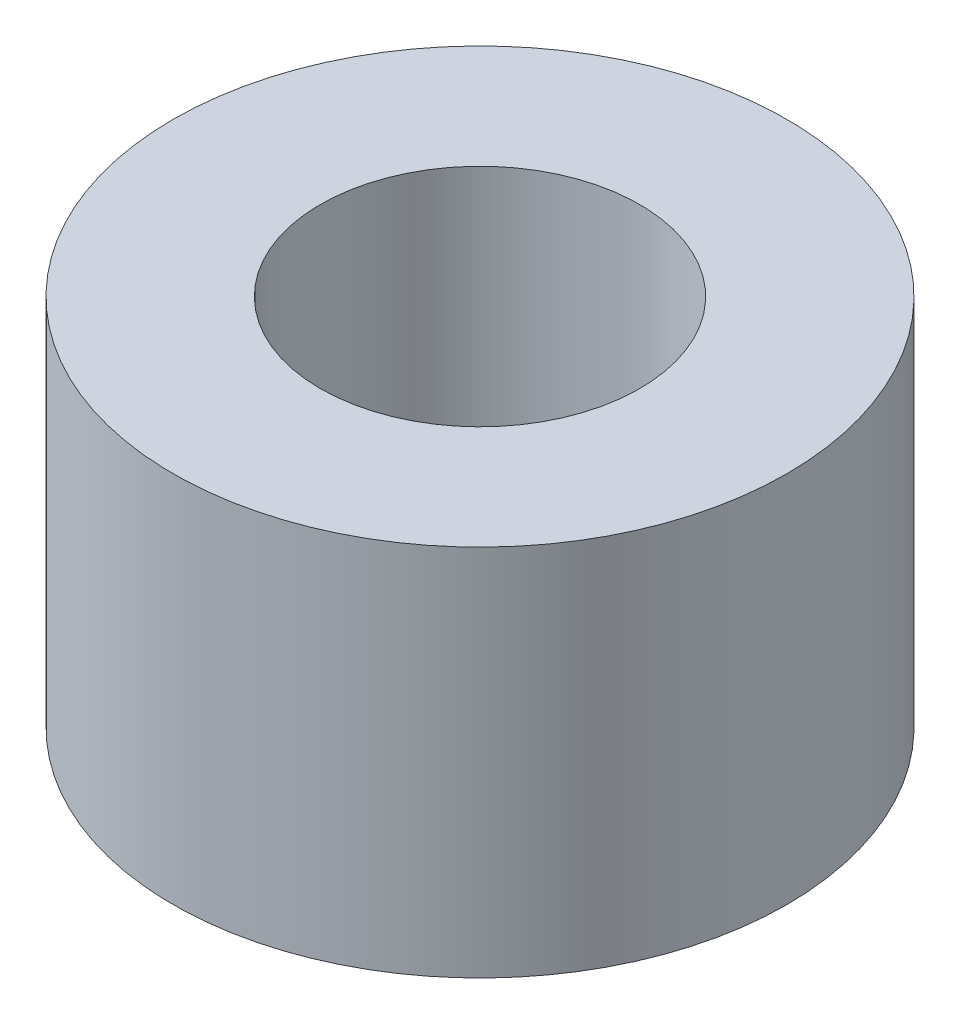
ISO-10303-21;
HEADER;
FILE_DESCRIPTION(('STEP AP214'),'2;1');
FILE_NAME('part.step','',(''),(''),'','','');
FILE_SCHEMA(('AUTOMOTIVE_DESIGN { 1 0 10303 214 1 1 1 1 }'));
ENDSEC;
DATA;
#1=APPLICATION_CONTEXT('core data for automotive mechanical design processes');
#2=APPLICATION_PROTOCOL_DEFINITION('international standard','automotive_design',2000,#1);
#3=PRODUCT_CONTEXT('',#1,'mechanical');
#4=PRODUCT('Part','Part','',(#3));
#5=PRODUCT_RELATED_PRODUCT_CATEGORY('part','',(#4));
#6=PRODUCT_DEFINITION_FORMATION('','',#4);
#7=PRODUCT_DEFINITION_CONTEXT('part definition',#1,'design');
#8=PRODUCT_DEFINITION('design','',#6,#7);
#9=PRODUCT_DEFINITION_SHAPE('','',#8);
#10=(LENGTH_UNIT() NAMED_UNIT(*) SI_UNIT(.MILLI.,.METRE.));
#11=(NAMED_UNIT(*) PLANE_ANGLE_UNIT() SI_UNIT($,.RADIAN.));
#12=(NAMED_UNIT(*) SI_UNIT($,.STERADIAN.) SOLID_ANGLE_UNIT());
#13=UNCERTAINTY_MEASURE_WITH_UNIT(LENGTH_MEASURE(1.E-05),#10,'distance_accuracy_value','');
#14=(GEOMETRIC_REPRESENTATION_CONTEXT(3) GLOBAL_UNCERTAINTY_ASSIGNED_CONTEXT((#13)) GLOBAL_UNIT_ASSIGNED_CONTEXT((#10,
#11,#12)) REPRESENTATION_CONTEXT('',''));
#15=CARTESIAN_POINT('',(0.,0.,0.));
#16=DIRECTION('',(0.,0.,1.));
#17=DIRECTION('',(1.,0.,0.));
#18=AXIS2_PLACEMENT_3D('',#15,#16,#17);
#19=CARTESIAN_POINT('',(0.,7.6,0.));
#20=DIRECTION('',(0.,1.,0.));
#21=DIRECTION('',(0.,0.,1.));
#22=AXIS2_PLACEMENT_3D('',#19,#20,#21);
#23=PLANE('',#22);
#24=CARTESIAN_POINT('',(0.,7.6,0.));
#25=DIRECTION('',(0.,1.,0.));
#26=DIRECTION('',(1.,0.,0.));
#27=AXIS2_PLACEMENT_3D('',#24,#25,#26);
#28=CIRCLE('',#27,6.25);
#29=CARTESIAN_POINT('',(6.25,7.6,0.));
#30=VERTEX_POINT('',#29);
#31=EDGE_CURVE('E11',#30,#30,#28,.T.);
#32=ORIENTED_EDGE('',*,*,#31,.T.);
#33=EDGE_LOOP('',(#32));
#34=FACE_BOUND('',#33,.T.);
#35=CARTESIAN_POINT('',(0.,7.6,0.));
#36=DIRECTION('',(0.,1.,0.));
#37=DIRECTION('',(0.,0.,1.));
#38=AXIS2_PLACEMENT_3D('',#35,#36,#37);
#39=CIRCLE('',#38,3.25);
#40=CARTESIAN_POINT('',(0.,7.6,3.25));
#41=VERTEX_POINT('',#40);
#42=EDGE_CURVE('E47',#41,#41,#39,.T.);
#43=ORIENTED_EDGE('',*,*,#42,.F.);
#44=EDGE_LOOP('',(#43));
#45=FACE_BOUND('',#44,.T.);
#46=ADVANCED_FACE('F36',(#34,#45),#23,.T.);
#47=CARTESIAN_POINT('',(0.,0.,0.));
#48=DIRECTION('',(0.,1.,0.));
#49=DIRECTION('',(0.,0.,1.));
#50=AXIS2_PLACEMENT_3D('',#47,#48,#49);
#51=PLANE('',#50);
#52=CARTESIAN_POINT('',(0.,0.,0.));
#53=DIRECTION('',(0.,1.,0.));
#54=DIRECTION('',(1.,0.,0.));
#55=AXIS2_PLACEMENT_3D('',#52,#53,#54);
#56=CIRCLE('',#55,6.25);
#57=CARTESIAN_POINT('',(6.25,0.,0.));
#58=VERTEX_POINT('',#57);
#59=EDGE_CURVE('E40',#58,#58,#56,.T.);
#60=ORIENTED_EDGE('',*,*,#59,.F.);
#61=EDGE_LOOP('',(#60));
#62=FACE_BOUND('',#61,.T.);
#63=CARTESIAN_POINT('',(0.,0.,0.));
#64=DIRECTION('',(0.,1.,0.));
#65=DIRECTION('',(0.,0.,1.));
#66=AXIS2_PLACEMENT_3D('',#63,#64,#65);
#67=CIRCLE('',#66,3.25);
#68=CARTESIAN_POINT('',(0.,0.,3.25));
#69=VERTEX_POINT('',#68);
#70=EDGE_CURVE('E49',#69,#69,#67,.T.);
#71=ORIENTED_EDGE('',*,*,#70,.T.);
#72=EDGE_LOOP('',(#71));
#73=FACE_BOUND('',#72,.T.);
#74=ADVANCED_FACE('F59',(#62,#73),#51,.F.);
#75=CARTESIAN_POINT('',(0.,7.6,0.));
#76=DIRECTION('',(0.,-1.,0.));
#77=DIRECTION('',(0.,0.,-1.));
#78=AXIS2_PLACEMENT_3D('',#75,#76,#77);
#79=CYLINDRICAL_SURFACE('',#78,6.25);
#80=ORIENTED_EDGE('',*,*,#31,.F.);
#81=EDGE_LOOP('',(#80));
#82=FACE_BOUND('',#81,.T.);
#83=ORIENTED_EDGE('',*,*,#59,.T.);
#84=EDGE_LOOP('',(#83));
#85=FACE_BOUND('',#84,.T.);
#86=ADVANCED_FACE('F38',(#82,#85),#79,.T.);
#87=CARTESIAN_POINT('',(0.,7.6,0.));
#88=DIRECTION('',(0.,-1.,0.));
#89=DIRECTION('',(0.,0.,-1.));
#90=AXIS2_PLACEMENT_3D('',#87,#88,#89);
#91=CYLINDRICAL_SURFACE('',#90,3.25);
#92=ORIENTED_EDGE('',*,*,#42,.T.);
#93=EDGE_LOOP('',(#92));
#94=FACE_BOUND('',#93,.T.);
#95=ORIENTED_EDGE('',*,*,#70,.F.);
#96=EDGE_LOOP('',(#95));
#97=FACE_BOUND('',#96,.T.);
#98=ADVANCED_FACE('F55',(#94,#97),#91,.F.);
#99=CLOSED_SHELL('',(#46,#74,#86,#98));
#100=MANIFOLD_SOLID_BREP('B2',#99);
#101=ADVANCED_BREP_SHAPE_REPRESENTATION('',(#18,#100),#14);
#102=SHAPE_DEFINITION_REPRESENTATION(#9,#101);
ENDSEC;
END-ISO-10303-21;
